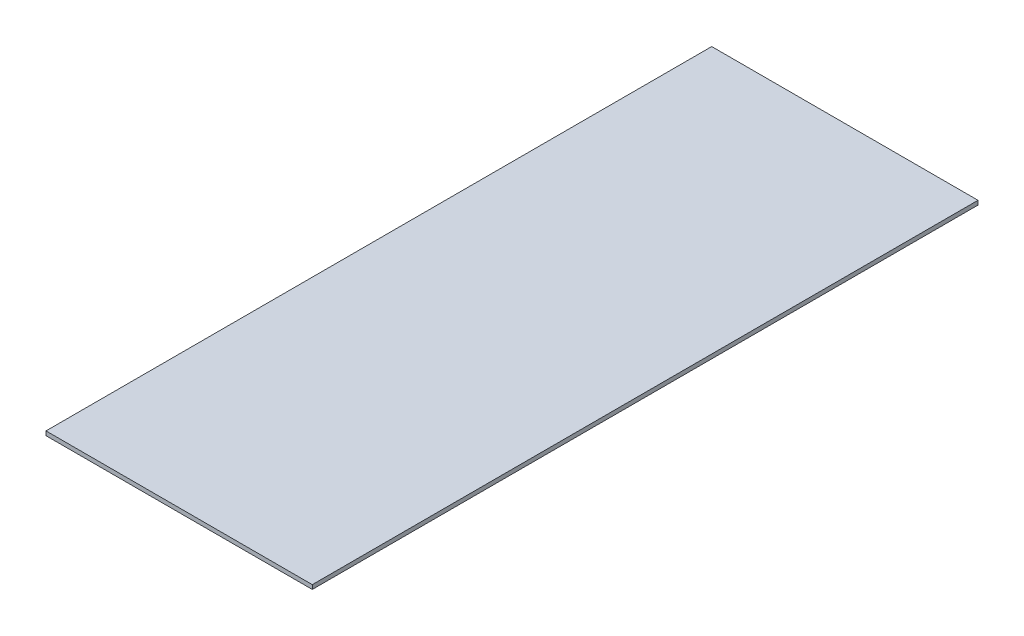
ISO-10303-21;
HEADER;
FILE_DESCRIPTION(('STEP AP214'),'2;1');
FILE_NAME('part.step','',(''),(''),'','','');
FILE_SCHEMA(('AUTOMOTIVE_DESIGN { 1 0 10303 214 1 1 1 1 }'));
ENDSEC;
DATA;
#1=APPLICATION_CONTEXT('core data for automotive mechanical design processes');
#2=APPLICATION_PROTOCOL_DEFINITION('international standard','automotive_design',2000,#1);
#3=PRODUCT_CONTEXT('',#1,'mechanical');
#4=PRODUCT('Part','Part','',(#3));
#5=PRODUCT_RELATED_PRODUCT_CATEGORY('part','',(#4));
#6=PRODUCT_DEFINITION_FORMATION('','',#4);
#7=PRODUCT_DEFINITION_CONTEXT('part definition',#1,'design');
#8=PRODUCT_DEFINITION('design','',#6,#7);
#9=PRODUCT_DEFINITION_SHAPE('','',#8);
#10=(LENGTH_UNIT() NAMED_UNIT(*) SI_UNIT(.MILLI.,.METRE.));
#11=(NAMED_UNIT(*) PLANE_ANGLE_UNIT() SI_UNIT($,.RADIAN.));
#12=(NAMED_UNIT(*) SI_UNIT($,.STERADIAN.) SOLID_ANGLE_UNIT());
#13=UNCERTAINTY_MEASURE_WITH_UNIT(LENGTH_MEASURE(1.E-05),#10,'distance_accuracy_value','');
#14=(GEOMETRIC_REPRESENTATION_CONTEXT(3) GLOBAL_UNCERTAINTY_ASSIGNED_CONTEXT((#13)) GLOBAL_UNIT_ASSIGNED_CONTEXT((#10,
#11,#12)) REPRESENTATION_CONTEXT('',''));
#15=CARTESIAN_POINT('',(0.,0.,0.));
#16=DIRECTION('',(0.,0.,1.));
#17=DIRECTION('',(1.,0.,0.));
#18=AXIS2_PLACEMENT_3D('',#15,#16,#17);
#19=CARTESIAN_POINT('',(0.,3.175,0.));
#20=DIRECTION('',(1.,0.,0.));
#21=DIRECTION('',(0.,0.,-1.));
#22=AXIS2_PLACEMENT_3D('',#19,#20,#21);
#23=PLANE('',#22);
#24=DIRECTION('',(0.,0.,1.));
#25=VECTOR('',#24,1.);
#26=CARTESIAN_POINT('',(0.,0.,0.));
#27=LINE('',#26,#25);
#28=CARTESIAN_POINT('',(0.,0.,-505.));
#29=VERTEX_POINT('',#28);
#30=CARTESIAN_POINT('',(0.,0.,0.));
#31=VERTEX_POINT('',#30);
#32=EDGE_CURVE('E96',#29,#31,#27,.T.);
#33=ORIENTED_EDGE('',*,*,#32,.T.);
#34=DIRECTION('',(0.,-1.,0.));
#35=VECTOR('',#34,1.);
#36=CARTESIAN_POINT('',(0.,3.175,0.));
#37=LINE('',#36,#35);
#38=CARTESIAN_POINT('',(0.,3.175,0.));
#39=VERTEX_POINT('',#38);
#40=EDGE_CURVE('E11',#39,#31,#37,.T.);
#41=ORIENTED_EDGE('',*,*,#40,.F.);
#42=DIRECTION('',(0.,0.,1.));
#43=VECTOR('',#42,1.);
#44=CARTESIAN_POINT('',(0.,3.175,0.));
#45=LINE('',#44,#43);
#46=CARTESIAN_POINT('',(0.,3.175,-505.));
#47=VERTEX_POINT('',#46);
#48=EDGE_CURVE('E84',#47,#39,#45,.T.);
#49=ORIENTED_EDGE('',*,*,#48,.F.);
#50=DIRECTION('',(0.,-1.,0.));
#51=VECTOR('',#50,1.);
#52=CARTESIAN_POINT('',(0.,3.175,-505.));
#53=LINE('',#52,#51);
#54=EDGE_CURVE('E92',#47,#29,#53,.T.);
#55=ORIENTED_EDGE('',*,*,#54,.T.);
#56=EDGE_LOOP('',(#33,#41,#49,#55));
#57=FACE_BOUND('',#56,.T.);
#58=ADVANCED_FACE('F33',(#57),#23,.F.);
#59=CARTESIAN_POINT('',(0.,3.175,0.));
#60=DIRECTION('',(0.,0.,-1.));
#61=DIRECTION('',(-1.,0.,0.));
#62=AXIS2_PLACEMENT_3D('',#59,#60,#61);
#63=PLANE('',#62);
#64=DIRECTION('',(1.,0.,0.));
#65=VECTOR('',#64,1.);
#66=CARTESIAN_POINT('',(0.,0.,0.));
#67=LINE('',#66,#65);
#68=CARTESIAN_POINT('',(202.,0.,0.));
#69=VERTEX_POINT('',#68);
#70=EDGE_CURVE('E88',#31,#69,#67,.T.);
#71=ORIENTED_EDGE('',*,*,#70,.T.);
#72=DIRECTION('',(0.,-1.,0.));
#73=VECTOR('',#72,1.);
#74=CARTESIAN_POINT('',(202.,3.175,0.));
#75=LINE('',#74,#73);
#76=CARTESIAN_POINT('',(202.,3.175,0.));
#77=VERTEX_POINT('',#76);
#78=EDGE_CURVE('E41',#77,#69,#75,.T.);
#79=ORIENTED_EDGE('',*,*,#78,.F.);
#80=DIRECTION('',(1.,0.,0.));
#81=VECTOR('',#80,1.);
#82=CARTESIAN_POINT('',(0.,3.175,0.));
#83=LINE('',#82,#81);
#84=EDGE_CURVE('E79',#39,#77,#83,.T.);
#85=ORIENTED_EDGE('',*,*,#84,.F.);
#86=ORIENTED_EDGE('',*,*,#40,.T.);
#87=EDGE_LOOP('',(#71,#79,#85,#86));
#88=FACE_BOUND('',#87,.T.);
#89=ADVANCED_FACE('F87',(#88),#63,.F.);
#90=CARTESIAN_POINT('',(202.,3.175,0.));
#91=DIRECTION('',(-1.,0.,0.));
#92=DIRECTION('',(0.,0.,1.));
#93=AXIS2_PLACEMENT_3D('',#90,#91,#92);
#94=PLANE('',#93);
#95=DIRECTION('',(0.,0.,-1.));
#96=VECTOR('',#95,1.);
#97=CARTESIAN_POINT('',(202.,0.,0.));
#98=LINE('',#97,#96);
#99=CARTESIAN_POINT('',(202.,0.,-505.));
#100=VERTEX_POINT('',#99);
#101=EDGE_CURVE('E66',#69,#100,#98,.T.);
#102=ORIENTED_EDGE('',*,*,#101,.T.);
#103=DIRECTION('',(0.,-1.,0.));
#104=VECTOR('',#103,1.);
#105=CARTESIAN_POINT('',(202.,3.175,-505.));
#106=LINE('',#105,#104);
#107=CARTESIAN_POINT('',(202.,3.175,-505.));
#108=VERTEX_POINT('',#107);
#109=EDGE_CURVE('E89',#108,#100,#106,.T.);
#110=ORIENTED_EDGE('',*,*,#109,.F.);
#111=DIRECTION('',(0.,0.,-1.));
#112=VECTOR('',#111,1.);
#113=CARTESIAN_POINT('',(202.,3.175,0.));
#114=LINE('',#113,#112);
#115=EDGE_CURVE('E82',#77,#108,#114,.T.);
#116=ORIENTED_EDGE('',*,*,#115,.F.);
#117=ORIENTED_EDGE('',*,*,#78,.T.);
#118=EDGE_LOOP('',(#102,#110,#116,#117));
#119=FACE_BOUND('',#118,.T.);
#120=ADVANCED_FACE('F90',(#119),#94,.F.);
#121=CARTESIAN_POINT('',(0.,3.175,-505.));
#122=DIRECTION('',(0.,0.,1.));
#123=DIRECTION('',(1.,0.,0.));
#124=AXIS2_PLACEMENT_3D('',#121,#122,#123);
#125=PLANE('',#124);
#126=DIRECTION('',(-1.,0.,0.));
#127=VECTOR('',#126,1.);
#128=CARTESIAN_POINT('',(0.,0.,-505.));
#129=LINE('',#128,#127);
#130=EDGE_CURVE('E72',#100,#29,#129,.T.);
#131=ORIENTED_EDGE('',*,*,#130,.T.);
#132=ORIENTED_EDGE('',*,*,#54,.F.);
#133=DIRECTION('',(-1.,0.,0.));
#134=VECTOR('',#133,1.);
#135=CARTESIAN_POINT('',(0.,3.175,-505.));
#136=LINE('',#135,#134);
#137=EDGE_CURVE('E49',#108,#47,#136,.T.);
#138=ORIENTED_EDGE('',*,*,#137,.F.);
#139=ORIENTED_EDGE('',*,*,#109,.T.);
#140=EDGE_LOOP('',(#131,#132,#138,#139));
#141=FACE_BOUND('',#140,.T.);
#142=ADVANCED_FACE('F103',(#141),#125,.F.);
#143=CARTESIAN_POINT('',(0.,3.175,0.));
#144=DIRECTION('',(0.,-1.,0.));
#145=DIRECTION('',(0.,0.,-1.));
#146=AXIS2_PLACEMENT_3D('',#143,#144,#145);
#147=PLANE('',#146);
#148=ORIENTED_EDGE('',*,*,#48,.T.);
#149=ORIENTED_EDGE('',*,*,#84,.T.);
#150=ORIENTED_EDGE('',*,*,#115,.T.);
#151=ORIENTED_EDGE('',*,*,#137,.T.);
#152=EDGE_LOOP('',(#148,#149,#150,#151));
#153=FACE_BOUND('',#152,.T.);
#154=ADVANCED_FACE('F80',(#153),#147,.F.);
#155=CARTESIAN_POINT('',(0.,0.,0.));
#156=DIRECTION('',(0.,-1.,0.));
#157=DIRECTION('',(0.,0.,-1.));
#158=AXIS2_PLACEMENT_3D('',#155,#156,#157);
#159=PLANE('',#158);
#160=ORIENTED_EDGE('',*,*,#32,.F.);
#161=ORIENTED_EDGE('',*,*,#130,.F.);
#162=ORIENTED_EDGE('',*,*,#101,.F.);
#163=ORIENTED_EDGE('',*,*,#70,.F.);
#164=EDGE_LOOP('',(#160,#161,#162,#163));
#165=FACE_BOUND('',#164,.T.);
#166=ADVANCED_FACE('F106',(#165),#159,.T.);
#167=CLOSED_SHELL('',(#58,#89,#120,#142,#154,#166));
#168=MANIFOLD_SOLID_BREP('B2',#167);
#169=ADVANCED_BREP_SHAPE_REPRESENTATION('',(#18,#168),#14);
#170=SHAPE_DEFINITION_REPRESENTATION(#9,#169);
ENDSEC;
END-ISO-10303-21;
